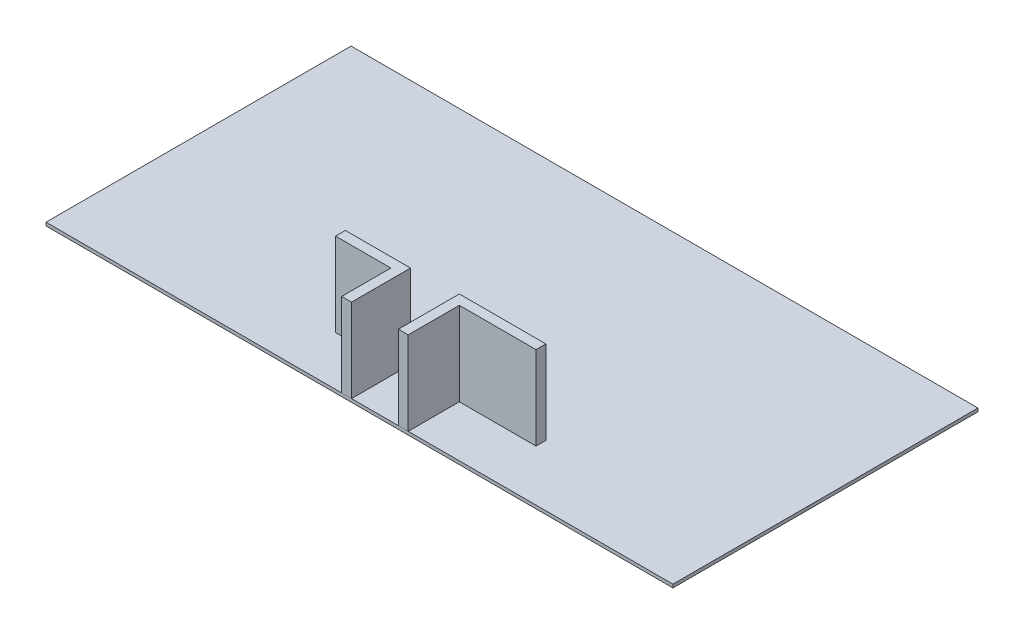
ISO-10303-21;
HEADER;
FILE_DESCRIPTION(('STEP AP214'),'2;1');
FILE_NAME('part.step','',(''),(''),'','','');
FILE_SCHEMA(('AUTOMOTIVE_DESIGN { 1 0 10303 214 1 1 1 1 }'));
ENDSEC;
DATA;
#1=APPLICATION_CONTEXT('core data for automotive mechanical design processes');
#2=APPLICATION_PROTOCOL_DEFINITION('international standard','automotive_design',2000,#1);
#3=PRODUCT_CONTEXT('',#1,'mechanical');
#4=PRODUCT('Part','Part','',(#3));
#5=PRODUCT_RELATED_PRODUCT_CATEGORY('part','',(#4));
#6=PRODUCT_DEFINITION_FORMATION('','',#4);
#7=PRODUCT_DEFINITION_CONTEXT('part definition',#1,'design');
#8=PRODUCT_DEFINITION('design','',#6,#7);
#9=PRODUCT_DEFINITION_SHAPE('','',#8);
#10=(LENGTH_UNIT() NAMED_UNIT(*) SI_UNIT(.MILLI.,.METRE.));
#11=(NAMED_UNIT(*) PLANE_ANGLE_UNIT() SI_UNIT($,.RADIAN.));
#12=(NAMED_UNIT(*) SI_UNIT($,.STERADIAN.) SOLID_ANGLE_UNIT());
#13=UNCERTAINTY_MEASURE_WITH_UNIT(LENGTH_MEASURE(1.E-05),#10,'distance_accuracy_value','');
#14=(GEOMETRIC_REPRESENTATION_CONTEXT(3) GLOBAL_UNCERTAINTY_ASSIGNED_CONTEXT((#13)) GLOBAL_UNIT_ASSIGNED_CONTEXT((#10,
#11,#12)) REPRESENTATION_CONTEXT('',''));
#15=CARTESIAN_POINT('',(0.,0.,0.));
#16=DIRECTION('',(0.,0.,1.));
#17=DIRECTION('',(1.,0.,0.));
#18=AXIS2_PLACEMENT_3D('',#15,#16,#17);
#19=CARTESIAN_POINT('',(-9023.74356584846,-100.,1800.));
#20=DIRECTION('',(1.,0.,0.));
#21=DIRECTION('',(0.,0.,-1.));
#22=AXIS2_PLACEMENT_3D('',#19,#20,#21);
#23=PLANE('',#22);
#24=DIRECTION('',(0.,0.,-1.));
#25=VECTOR('',#24,1.);
#26=CARTESIAN_POINT('',(-9023.74356584846,0.,1800.));
#27=LINE('',#26,#25);
#28=CARTESIAN_POINT('',(-9023.74356584846,0.,1800.));
#29=VERTEX_POINT('',#28);
#30=CARTESIAN_POINT('',(-9023.74356584846,0.,-7509.60475321558));
#31=VERTEX_POINT('',#30);
#32=EDGE_CURVE('E108',#29,#31,#27,.T.);
#33=ORIENTED_EDGE('',*,*,#32,.T.);
#34=DIRECTION('',(0.,1.,0.));
#35=VECTOR('',#34,1.);
#36=CARTESIAN_POINT('',(-9023.74356584846,-100.,-7509.60475321558));
#37=LINE('',#36,#35);
#38=CARTESIAN_POINT('',(-9023.74356584846,-100.,-7509.60475321558));
#39=VERTEX_POINT('',#38);
#40=EDGE_CURVE('E12',#39,#31,#37,.T.);
#41=ORIENTED_EDGE('',*,*,#40,.F.);
#42=DIRECTION('',(0.,0.,-1.));
#43=VECTOR('',#42,1.);
#44=CARTESIAN_POINT('',(-9023.74356584846,-100.,1800.));
#45=LINE('',#44,#43);
#46=CARTESIAN_POINT('',(-9023.74356584846,-100.,1800.));
#47=VERTEX_POINT('',#46);
#48=EDGE_CURVE('E96',#47,#39,#45,.T.);
#49=ORIENTED_EDGE('',*,*,#48,.F.);
#50=DIRECTION('',(0.,1.,0.));
#51=VECTOR('',#50,1.);
#52=CARTESIAN_POINT('',(-9023.74356584846,-100.,1800.));
#53=LINE('',#52,#51);
#54=EDGE_CURVE('E104',#47,#29,#53,.T.);
#55=ORIENTED_EDGE('',*,*,#54,.T.);
#56=EDGE_LOOP('',(#33,#41,#49,#55));
#57=FACE_BOUND('',#56,.T.);
#58=ADVANCED_FACE('F45',(#57),#23,.F.);
#59=CARTESIAN_POINT('',(-9023.74356584846,-100.,-7509.60475321558));
#60=DIRECTION('',(0.,0.,1.));
#61=DIRECTION('',(1.,0.,0.));
#62=AXIS2_PLACEMENT_3D('',#59,#60,#61);
#63=PLANE('',#62);
#64=DIRECTION('',(1.,0.,0.));
#65=VECTOR('',#64,1.);
#66=CARTESIAN_POINT('',(-9023.74356584846,0.,-7509.60475321558));
#67=LINE('',#66,#65);
#68=CARTESIAN_POINT('',(10107.5864082724,0.,-7509.60475321558));
#69=VERTEX_POINT('',#68);
#70=EDGE_CURVE('E100',#31,#69,#67,.T.);
#71=ORIENTED_EDGE('',*,*,#70,.T.);
#72=DIRECTION('',(0.,1.,0.));
#73=VECTOR('',#72,1.);
#74=CARTESIAN_POINT('',(10107.5864082724,-100.,-7509.60475321558));
#75=LINE('',#74,#73);
#76=CARTESIAN_POINT('',(10107.5864082724,-100.,-7509.60475321558));
#77=VERTEX_POINT('',#76);
#78=EDGE_CURVE('E53',#77,#69,#75,.T.);
#79=ORIENTED_EDGE('',*,*,#78,.F.);
#80=DIRECTION('',(1.,0.,0.));
#81=VECTOR('',#80,1.);
#82=CARTESIAN_POINT('',(-9023.74356584846,-100.,-7509.60475321558));
#83=LINE('',#82,#81);
#84=EDGE_CURVE('E91',#39,#77,#83,.T.);
#85=ORIENTED_EDGE('',*,*,#84,.F.);
#86=ORIENTED_EDGE('',*,*,#40,.T.);
#87=EDGE_LOOP('',(#71,#79,#85,#86));
#88=FACE_BOUND('',#87,.T.);
#89=ADVANCED_FACE('F99',(#88),#63,.F.);
#90=CARTESIAN_POINT('',(10107.5864082724,-100.,1800.));
#91=DIRECTION('',(-1.,0.,0.));
#92=DIRECTION('',(0.,0.,1.));
#93=AXIS2_PLACEMENT_3D('',#90,#91,#92);
#94=PLANE('',#93);
#95=DIRECTION('',(0.,0.,1.));
#96=VECTOR('',#95,1.);
#97=CARTESIAN_POINT('',(10107.5864082724,0.,1800.));
#98=LINE('',#97,#96);
#99=CARTESIAN_POINT('',(10107.5864082724,0.,1800.));
#100=VERTEX_POINT('',#99);
#101=EDGE_CURVE('E78',#69,#100,#98,.T.);
#102=ORIENTED_EDGE('',*,*,#101,.T.);
#103=DIRECTION('',(0.,1.,0.));
#104=VECTOR('',#103,1.);
#105=CARTESIAN_POINT('',(10107.5864082724,-100.,1800.));
#106=LINE('',#105,#104);
#107=CARTESIAN_POINT('',(10107.5864082724,-100.,1800.));
#108=VERTEX_POINT('',#107);
#109=EDGE_CURVE('E101',#108,#100,#106,.T.);
#110=ORIENTED_EDGE('',*,*,#109,.F.);
#111=DIRECTION('',(0.,0.,1.));
#112=VECTOR('',#111,1.);
#113=CARTESIAN_POINT('',(10107.5864082724,-100.,1800.));
#114=LINE('',#113,#112);
#115=EDGE_CURVE('E94',#77,#108,#114,.T.);
#116=ORIENTED_EDGE('',*,*,#115,.F.);
#117=ORIENTED_EDGE('',*,*,#78,.T.);
#118=EDGE_LOOP('',(#102,#110,#116,#117));
#119=FACE_BOUND('',#118,.T.);
#120=ADVANCED_FACE('F102',(#119),#94,.F.);
#121=CARTESIAN_POINT('',(-9023.74356584846,-100.,1800.));
#122=DIRECTION('',(0.,0.,-1.));
#123=DIRECTION('',(-1.,0.,0.));
#124=AXIS2_PLACEMENT_3D('',#121,#122,#123);
#125=PLANE('',#124);
#126=DIRECTION('',(-1.,0.,0.));
#127=VECTOR('',#126,1.);
#128=CARTESIAN_POINT('',(-9023.74356584846,0.,1800.));
#129=LINE('',#128,#127);
#130=EDGE_CURVE('E84',#100,#29,#129,.T.);
#131=ORIENTED_EDGE('',*,*,#130,.T.);
#132=ORIENTED_EDGE('',*,*,#54,.F.);
#133=DIRECTION('',(-1.,0.,0.));
#134=VECTOR('',#133,1.);
#135=CARTESIAN_POINT('',(-9023.74356584846,-100.,1800.));
#136=LINE('',#135,#134);
#137=EDGE_CURVE('E61',#108,#47,#136,.T.);
#138=ORIENTED_EDGE('',*,*,#137,.F.);
#139=ORIENTED_EDGE('',*,*,#109,.T.);
#140=EDGE_LOOP('',(#131,#132,#138,#139));
#141=FACE_BOUND('',#140,.T.);
#142=ADVANCED_FACE('F115',(#141),#125,.F.);
#143=CARTESIAN_POINT('',(0.,-100.,0.));
#144=DIRECTION('',(0.,-1.,0.));
#145=DIRECTION('',(0.,0.,-1.));
#146=AXIS2_PLACEMENT_3D('',#143,#144,#145);
#147=PLANE('',#146);
#148=ORIENTED_EDGE('',*,*,#48,.T.);
#149=ORIENTED_EDGE('',*,*,#84,.T.);
#150=ORIENTED_EDGE('',*,*,#115,.T.);
#151=ORIENTED_EDGE('',*,*,#137,.T.);
#152=EDGE_LOOP('',(#148,#149,#150,#151));
#153=FACE_BOUND('',#152,.T.);
#154=ADVANCED_FACE('F92',(#153),#147,.T.);
#155=CARTESIAN_POINT('',(0.,0.,0.));
#156=DIRECTION('',(0.,-1.,0.));
#157=DIRECTION('',(0.,0.,-1.));
#158=AXIS2_PLACEMENT_3D('',#155,#156,#157);
#159=PLANE('',#158);
#160=ORIENTED_EDGE('',*,*,#32,.F.);
#161=ORIENTED_EDGE('',*,*,#130,.F.);
#162=ORIENTED_EDGE('',*,*,#101,.F.);
#163=ORIENTED_EDGE('',*,*,#70,.F.);
#164=EDGE_LOOP('',(#160,#161,#162,#163));
#165=FACE_BOUND('',#164,.T.);
#166=ADVANCED_FACE('F118',(#165),#159,.F.);
#167=CLOSED_SHELL('',(#58,#89,#120,#142,#154,#166));
#168=MANIFOLD_SOLID_BREP('B2',#167);
#169=CARTESIAN_POINT('',(-1687.59713801505,2550.,2.43410447306457E-13));
#170=DIRECTION('',(1.,0.,0.));
#171=DIRECTION('',(0.,0.,-1.));
#172=AXIS2_PLACEMENT_3D('',#169,#170,#171);
#173=PLANE('',#172);
#174=DIRECTION('',(0.,0.,1.));
#175=VECTOR('',#174,1.);
#176=CARTESIAN_POINT('',(-1687.59713801505,0.,2.43410447306457E-13));
#177=LINE('',#176,#175);
#178=CARTESIAN_POINT('',(-1687.59713801505,0.,2.43410447306457E-13));
#179=VERTEX_POINT('',#178);
#180=CARTESIAN_POINT('',(-1687.59713801505,0.,300.));
#181=VERTEX_POINT('',#180);
#182=EDGE_CURVE('E263',#179,#181,#177,.T.);
#183=ORIENTED_EDGE('',*,*,#182,.T.);
#184=DIRECTION('',(0.,-1.,0.));
#185=VECTOR('',#184,1.);
#186=CARTESIAN_POINT('',(-1687.59713801505,2550.,300.));
#187=LINE('',#186,#185);
#188=CARTESIAN_POINT('',(-1687.59713801505,2550.,300.));
#189=VERTEX_POINT('',#188);
#190=EDGE_CURVE('E43',#189,#181,#187,.T.);
#191=ORIENTED_EDGE('',*,*,#190,.F.);
#192=DIRECTION('',(0.,0.,1.));
#193=VECTOR('',#192,1.);
#194=CARTESIAN_POINT('',(-1687.59713801505,2550.,2.43410447306457E-13));
#195=LINE('',#194,#193);
#196=CARTESIAN_POINT('',(-1687.59713801505,2550.,2.43410447306457E-13));
#197=VERTEX_POINT('',#196);
#198=EDGE_CURVE('E273',#197,#189,#195,.T.);
#199=ORIENTED_EDGE('',*,*,#198,.F.);
#200=DIRECTION('',(0.,-1.,0.));
#201=VECTOR('',#200,1.);
#202=CARTESIAN_POINT('',(-1687.59713801505,2550.,2.43410447306457E-13));
#203=LINE('',#202,#201);
#204=EDGE_CURVE('E259',#197,#179,#203,.T.);
#205=ORIENTED_EDGE('',*,*,#204,.T.);
#206=EDGE_LOOP('',(#183,#191,#199,#205));
#207=FACE_BOUND('',#206,.T.);
#208=ADVANCED_FACE('F179',(#207),#173,.F.);
#209=CARTESIAN_POINT('',(-1687.59713801505,2550.,300.));
#210=DIRECTION('',(0.,0.,-1.));
#211=DIRECTION('',(-1.,0.,0.));
#212=AXIS2_PLACEMENT_3D('',#209,#210,#211);
#213=PLANE('',#212);
#214=DIRECTION('',(1.,0.,0.));
#215=VECTOR('',#214,1.);
#216=CARTESIAN_POINT('',(-1687.59713801505,0.,300.));
#217=LINE('',#216,#215);
#218=CARTESIAN_POINT('',(0.,0.,300.));
#219=VERTEX_POINT('',#218);
#220=EDGE_CURVE('E266',#181,#219,#217,.T.);
#221=ORIENTED_EDGE('',*,*,#220,.T.);
#222=DIRECTION('',(0.,-1.,0.));
#223=VECTOR('',#222,1.);
#224=CARTESIAN_POINT('',(0.,2550.,300.));
#225=LINE('',#224,#223);
#226=CARTESIAN_POINT('',(0.,2550.,300.));
#227=VERTEX_POINT('',#226);
#228=EDGE_CURVE('E187',#227,#219,#225,.T.);
#229=ORIENTED_EDGE('',*,*,#228,.F.);
#230=DIRECTION('',(1.,0.,0.));
#231=VECTOR('',#230,1.);
#232=CARTESIAN_POINT('',(-1687.59713801505,2550.,300.));
#233=LINE('',#232,#231);
#234=EDGE_CURVE('E232',#189,#227,#233,.T.);
#235=ORIENTED_EDGE('',*,*,#234,.F.);
#236=ORIENTED_EDGE('',*,*,#190,.T.);
#237=EDGE_LOOP('',(#221,#229,#235,#236));
#238=FACE_BOUND('',#237,.T.);
#239=ADVANCED_FACE('F297',(#238),#213,.F.);
#240=CARTESIAN_POINT('',(0.,2550.,300.));
#241=DIRECTION('',(1.,0.,0.));
#242=DIRECTION('',(0.,0.,-1.));
#243=AXIS2_PLACEMENT_3D('',#240,#241,#242);
#244=PLANE('',#243);
#245=DIRECTION('',(0.,0.,1.));
#246=VECTOR('',#245,1.);
#247=CARTESIAN_POINT('',(0.,0.,300.));
#248=LINE('',#247,#246);
#249=CARTESIAN_POINT('',(1.83697019872103E-13,0.,1800.));
#250=VERTEX_POINT('',#249);
#251=EDGE_CURVE('E268',#219,#250,#248,.T.);
#252=ORIENTED_EDGE('',*,*,#251,.T.);
#253=DIRECTION('',(0.,-1.,0.));
#254=VECTOR('',#253,1.);
#255=CARTESIAN_POINT('',(1.83697019872103E-13,2550.,1800.));
#256=LINE('',#255,#254);
#257=CARTESIAN_POINT('',(1.83697019872103E-13,2550.,1800.));
#258=VERTEX_POINT('',#257);
#259=EDGE_CURVE('E254',#258,#250,#256,.T.);
#260=ORIENTED_EDGE('',*,*,#259,.F.);
#261=DIRECTION('',(0.,0.,1.));
#262=VECTOR('',#261,1.);
#263=CARTESIAN_POINT('',(0.,2550.,300.));
#264=LINE('',#263,#262);
#265=EDGE_CURVE('E245',#227,#258,#264,.T.);
#266=ORIENTED_EDGE('',*,*,#265,.F.);
#267=ORIENTED_EDGE('',*,*,#228,.T.);
#268=EDGE_LOOP('',(#252,#260,#266,#267));
#269=FACE_BOUND('',#268,.T.);
#270=ADVANCED_FACE('F279',(#269),#244,.F.);
#271=CARTESIAN_POINT('',(1.83697019872103E-13,2550.,1800.));
#272=DIRECTION('',(0.,0.,-1.));
#273=DIRECTION('',(-1.,0.,0.));
#274=AXIS2_PLACEMENT_3D('',#271,#272,#273);
#275=PLANE('',#274);
#276=DIRECTION('',(1.,0.,0.));
#277=VECTOR('',#276,1.);
#278=CARTESIAN_POINT('',(1.83697019872103E-13,0.,1800.));
#279=LINE('',#278,#277);
#280=CARTESIAN_POINT('',(300.,0.,1800.));
#281=VERTEX_POINT('',#280);
#282=EDGE_CURVE('E253',#250,#281,#279,.T.);
#283=ORIENTED_EDGE('',*,*,#282,.T.);
#284=DIRECTION('',(0.,-1.,0.));
#285=VECTOR('',#284,1.);
#286=CARTESIAN_POINT('',(300.,2550.,1800.));
#287=LINE('',#286,#285);
#288=CARTESIAN_POINT('',(300.,2550.,1800.));
#289=VERTEX_POINT('',#288);
#290=EDGE_CURVE('E250',#289,#281,#287,.T.);
#291=ORIENTED_EDGE('',*,*,#290,.F.);
#292=DIRECTION('',(1.,0.,0.));
#293=VECTOR('',#292,1.);
#294=CARTESIAN_POINT('',(1.83697019872103E-13,2550.,1800.));
#295=LINE('',#294,#293);
#296=EDGE_CURVE('E239',#258,#289,#295,.T.);
#297=ORIENTED_EDGE('',*,*,#296,.F.);
#298=ORIENTED_EDGE('',*,*,#259,.T.);
#299=EDGE_LOOP('',(#283,#291,#297,#298));
#300=FACE_BOUND('',#299,.T.);
#301=ADVANCED_FACE('F251',(#300),#275,.F.);
#302=CARTESIAN_POINT('',(300.,2550.,1800.));
#303=DIRECTION('',(-1.,0.,0.));
#304=DIRECTION('',(0.,0.,1.));
#305=AXIS2_PLACEMENT_3D('',#302,#303,#304);
#306=PLANE('',#305);
#307=DIRECTION('',(0.,0.,-1.));
#308=VECTOR('',#307,1.);
#309=CARTESIAN_POINT('',(300.,0.,1800.));
#310=LINE('',#309,#308);
#311=CARTESIAN_POINT('',(300.,0.,0.));
#312=VERTEX_POINT('',#311);
#313=EDGE_CURVE('E218',#281,#312,#310,.T.);
#314=ORIENTED_EDGE('',*,*,#313,.T.);
#315=DIRECTION('',(0.,-1.,0.));
#316=VECTOR('',#315,1.);
#317=CARTESIAN_POINT('',(300.,2550.,0.));
#318=LINE('',#317,#316);
#319=CARTESIAN_POINT('',(300.,2550.,0.));
#320=VERTEX_POINT('',#319);
#321=EDGE_CURVE('E255',#320,#312,#318,.T.);
#322=ORIENTED_EDGE('',*,*,#321,.F.);
#323=DIRECTION('',(0.,0.,-1.));
#324=VECTOR('',#323,1.);
#325=CARTESIAN_POINT('',(300.,2550.,1800.));
#326=LINE('',#325,#324);
#327=EDGE_CURVE('E243',#289,#320,#326,.T.);
#328=ORIENTED_EDGE('',*,*,#327,.F.);
#329=ORIENTED_EDGE('',*,*,#290,.T.);
#330=EDGE_LOOP('',(#314,#322,#328,#329));
#331=FACE_BOUND('',#330,.T.);
#332=ADVANCED_FACE('F257',(#331),#306,.F.);
#333=CARTESIAN_POINT('',(300.,2550.,0.));
#334=DIRECTION('',(0.,0.,1.));
#335=DIRECTION('',(1.,0.,0.));
#336=AXIS2_PLACEMENT_3D('',#333,#334,#335);
#337=PLANE('',#336);
#338=DIRECTION('',(-1.,0.,0.));
#339=VECTOR('',#338,1.);
#340=CARTESIAN_POINT('',(300.,0.,0.));
#341=LINE('',#340,#339);
#342=EDGE_CURVE('E224',#312,#179,#341,.T.);
#343=ORIENTED_EDGE('',*,*,#342,.T.);
#344=ORIENTED_EDGE('',*,*,#204,.F.);
#345=DIRECTION('',(-1.,0.,0.));
#346=VECTOR('',#345,1.);
#347=CARTESIAN_POINT('',(300.,2550.,0.));
#348=LINE('',#347,#346);
#349=EDGE_CURVE('E195',#320,#197,#348,.T.);
#350=ORIENTED_EDGE('',*,*,#349,.F.);
#351=ORIENTED_EDGE('',*,*,#321,.T.);
#352=EDGE_LOOP('',(#343,#344,#350,#351));
#353=FACE_BOUND('',#352,.T.);
#354=ADVANCED_FACE('F286',(#353),#337,.F.);
#355=CARTESIAN_POINT('',(0.,2550.,0.));
#356=DIRECTION('',(0.,1.,0.));
#357=DIRECTION('',(0.,0.,1.));
#358=AXIS2_PLACEMENT_3D('',#355,#356,#357);
#359=PLANE('',#358);
#360=ORIENTED_EDGE('',*,*,#198,.T.);
#361=ORIENTED_EDGE('',*,*,#234,.T.);
#362=ORIENTED_EDGE('',*,*,#265,.T.);
#363=ORIENTED_EDGE('',*,*,#296,.T.);
#364=ORIENTED_EDGE('',*,*,#327,.T.);
#365=ORIENTED_EDGE('',*,*,#349,.T.);
#366=EDGE_LOOP('',(#360,#361,#362,#363,#364,#365));
#367=FACE_BOUND('',#366,.T.);
#368=ADVANCED_FACE('F241',(#367),#359,.T.);
#369=CARTESIAN_POINT('',(0.,0.,0.));
#370=DIRECTION('',(0.,1.,0.));
#371=DIRECTION('',(0.,0.,1.));
#372=AXIS2_PLACEMENT_3D('',#369,#370,#371);
#373=PLANE('',#372);
#374=ORIENTED_EDGE('',*,*,#182,.F.);
#375=ORIENTED_EDGE('',*,*,#342,.F.);
#376=ORIENTED_EDGE('',*,*,#313,.F.);
#377=ORIENTED_EDGE('',*,*,#282,.F.);
#378=ORIENTED_EDGE('',*,*,#251,.F.);
#379=ORIENTED_EDGE('',*,*,#220,.F.);
#380=EDGE_LOOP('',(#374,#375,#376,#377,#378,#379));
#381=FACE_BOUND('',#380,.T.);
#382=ADVANCED_FACE('F282',(#381),#373,.F.);
#383=CLOSED_SHELL('',(#208,#239,#270,#301,#332,#354,#368,#382));
#384=MANIFOLD_SOLID_BREP('B6',#383);
#385=CARTESIAN_POINT('',(1730.,2550.,1800.));
#386=DIRECTION('',(1.,0.,0.));
#387=DIRECTION('',(0.,0.,-1.));
#388=AXIS2_PLACEMENT_3D('',#385,#386,#387);
#389=PLANE('',#388);
#390=DIRECTION('',(0.,0.,1.));
#391=VECTOR('',#390,1.);
#392=CARTESIAN_POINT('',(1730.,0.,1800.));
#393=LINE('',#392,#391);
#394=CARTESIAN_POINT('',(1730.,0.,-59.9999999999999));
#395=VERTEX_POINT('',#394);
#396=CARTESIAN_POINT('',(1730.,0.,1800.));
#397=VERTEX_POINT('',#396);
#398=EDGE_CURVE('E438',#395,#397,#393,.T.);
#399=ORIENTED_EDGE('',*,*,#398,.T.);
#400=DIRECTION('',(0.,-1.,0.));
#401=VECTOR('',#400,1.);
#402=CARTESIAN_POINT('',(1730.,2550.,1800.));
#403=LINE('',#402,#401);
#404=CARTESIAN_POINT('',(1730.,2550.,1800.));
#405=VERTEX_POINT('',#404);
#406=EDGE_CURVE('E177',#405,#397,#403,.T.);
#407=ORIENTED_EDGE('',*,*,#406,.F.);
#408=DIRECTION('',(0.,0.,1.));
#409=VECTOR('',#408,1.);
#410=CARTESIAN_POINT('',(1730.,2550.,1800.));
#411=LINE('',#410,#409);
#412=CARTESIAN_POINT('',(1730.,2550.,-59.9999999999999));
#413=VERTEX_POINT('',#412);
#414=EDGE_CURVE('E448',#413,#405,#411,.T.);
#415=ORIENTED_EDGE('',*,*,#414,.F.);
#416=DIRECTION('',(0.,-1.,0.));
#417=VECTOR('',#416,1.);
#418=CARTESIAN_POINT('',(1730.,2550.,-59.9999999999999));
#419=LINE('',#418,#417);
#420=EDGE_CURVE('E434',#413,#395,#419,.T.);
#421=ORIENTED_EDGE('',*,*,#420,.T.);
#422=EDGE_LOOP('',(#399,#407,#415,#421));
#423=FACE_BOUND('',#422,.T.);
#424=ADVANCED_FACE('F354',(#423),#389,.F.);
#425=CARTESIAN_POINT('',(2030.,2550.,1800.));
#426=DIRECTION('',(0.,0.,-1.));
#427=DIRECTION('',(-1.,0.,0.));
#428=AXIS2_PLACEMENT_3D('',#425,#426,#427);
#429=PLANE('',#428);
#430=DIRECTION('',(1.,0.,0.));
#431=VECTOR('',#430,1.);
#432=CARTESIAN_POINT('',(2030.,0.,1800.));
#433=LINE('',#432,#431);
#434=CARTESIAN_POINT('',(2030.,0.,1800.));
#435=VERTEX_POINT('',#434);
#436=EDGE_CURVE('E441',#397,#435,#433,.T.);
#437=ORIENTED_EDGE('',*,*,#436,.T.);
#438=DIRECTION('',(0.,-1.,0.));
#439=VECTOR('',#438,1.);
#440=CARTESIAN_POINT('',(2030.,2550.,1800.));
#441=LINE('',#440,#439);
#442=CARTESIAN_POINT('',(2030.,2550.,1800.));
#443=VERTEX_POINT('',#442);
#444=EDGE_CURVE('E362',#443,#435,#441,.T.);
#445=ORIENTED_EDGE('',*,*,#444,.F.);
#446=DIRECTION('',(1.,0.,0.));
#447=VECTOR('',#446,1.);
#448=CARTESIAN_POINT('',(2030.,2550.,1800.));
#449=LINE('',#448,#447);
#450=EDGE_CURVE('E407',#405,#443,#449,.T.);
#451=ORIENTED_EDGE('',*,*,#450,.F.);
#452=ORIENTED_EDGE('',*,*,#406,.T.);
#453=EDGE_LOOP('',(#437,#445,#451,#452));
#454=FACE_BOUND('',#453,.T.);
#455=ADVANCED_FACE('F472',(#454),#429,.F.);
#456=CARTESIAN_POINT('',(2030.,2550.,1800.));
#457=DIRECTION('',(-1.,0.,0.));
#458=DIRECTION('',(0.,0.,1.));
#459=AXIS2_PLACEMENT_3D('',#456,#457,#458);
#460=PLANE('',#459);
#461=DIRECTION('',(0.,0.,-1.));
#462=VECTOR('',#461,1.);
#463=CARTESIAN_POINT('',(2030.,0.,1800.));
#464=LINE('',#463,#462);
#465=CARTESIAN_POINT('',(2030.,0.,240.));
#466=VERTEX_POINT('',#465);
#467=EDGE_CURVE('E443',#435,#466,#464,.T.);
#468=ORIENTED_EDGE('',*,*,#467,.T.);
#469=DIRECTION('',(0.,-1.,0.));
#470=VECTOR('',#469,1.);
#471=CARTESIAN_POINT('',(2030.,2550.,240.));
#472=LINE('',#471,#470);
#473=CARTESIAN_POINT('',(2030.,2550.,240.));
#474=VERTEX_POINT('',#473);
#475=EDGE_CURVE('E429',#474,#466,#472,.T.);
#476=ORIENTED_EDGE('',*,*,#475,.F.);
#477=DIRECTION('',(0.,0.,-1.));
#478=VECTOR('',#477,1.);
#479=CARTESIAN_POINT('',(2030.,2550.,1800.));
#480=LINE('',#479,#478);
#481=EDGE_CURVE('E420',#443,#474,#480,.T.);
#482=ORIENTED_EDGE('',*,*,#481,.F.);
#483=ORIENTED_EDGE('',*,*,#444,.T.);
#484=EDGE_LOOP('',(#468,#476,#482,#483));
#485=FACE_BOUND('',#484,.T.);
#486=ADVANCED_FACE('F454',(#485),#460,.F.);
#487=CARTESIAN_POINT('',(2030.,2550.,240.));
#488=DIRECTION('',(0.,0.,-1.));
#489=DIRECTION('',(-1.,0.,0.));
#490=AXIS2_PLACEMENT_3D('',#487,#488,#489);
#491=PLANE('',#490);
#492=DIRECTION('',(1.,0.,0.));
#493=VECTOR('',#492,1.);
#494=CARTESIAN_POINT('',(2030.,0.,240.));
#495=LINE('',#494,#493);
#496=CARTESIAN_POINT('',(4369.5644478058,0.,240.));
#497=VERTEX_POINT('',#496);
#498=EDGE_CURVE('E428',#466,#497,#495,.T.);
#499=ORIENTED_EDGE('',*,*,#498,.T.);
#500=DIRECTION('',(0.,-1.,0.));
#501=VECTOR('',#500,1.);
#502=CARTESIAN_POINT('',(4369.5644478058,2550.,240.));
#503=LINE('',#502,#501);
#504=CARTESIAN_POINT('',(4369.5644478058,2550.,240.));
#505=VERTEX_POINT('',#504);
#506=EDGE_CURVE('E425',#505,#497,#503,.T.);
#507=ORIENTED_EDGE('',*,*,#506,.F.);
#508=DIRECTION('',(1.,0.,0.));
#509=VECTOR('',#508,1.);
#510=CARTESIAN_POINT('',(2030.,2550.,240.));
#511=LINE('',#510,#509);
#512=EDGE_CURVE('E414',#474,#505,#511,.T.);
#513=ORIENTED_EDGE('',*,*,#512,.F.);
#514=ORIENTED_EDGE('',*,*,#475,.T.);
#515=EDGE_LOOP('',(#499,#507,#513,#514));
#516=FACE_BOUND('',#515,.T.);
#517=ADVANCED_FACE('F426',(#516),#491,.F.);
#518=CARTESIAN_POINT('',(4369.5644478058,2550.,240.));
#519=DIRECTION('',(-1.,0.,0.));
#520=DIRECTION('',(0.,0.,1.));
#521=AXIS2_PLACEMENT_3D('',#518,#519,#520);
#522=PLANE('',#521);
#523=DIRECTION('',(0.,0.,-1.));
#524=VECTOR('',#523,1.);
#525=CARTESIAN_POINT('',(4369.5644478058,0.,240.));
#526=LINE('',#525,#524);
#527=CARTESIAN_POINT('',(4369.5644478058,0.,-59.9999999999999));
#528=VERTEX_POINT('',#527);
#529=EDGE_CURVE('E393',#497,#528,#526,.T.);
#530=ORIENTED_EDGE('',*,*,#529,.T.);
#531=DIRECTION('',(0.,-1.,0.));
#532=VECTOR('',#531,1.);
#533=CARTESIAN_POINT('',(4369.5644478058,2550.,-59.9999999999999));
#534=LINE('',#533,#532);
#535=CARTESIAN_POINT('',(4369.5644478058,2550.,-59.9999999999999));
#536=VERTEX_POINT('',#535);
#537=EDGE_CURVE('E430',#536,#528,#534,.T.);
#538=ORIENTED_EDGE('',*,*,#537,.F.);
#539=DIRECTION('',(0.,0.,-1.));
#540=VECTOR('',#539,1.);
#541=CARTESIAN_POINT('',(4369.5644478058,2550.,240.));
#542=LINE('',#541,#540);
#543=EDGE_CURVE('E418',#505,#536,#542,.T.);
#544=ORIENTED_EDGE('',*,*,#543,.F.);
#545=ORIENTED_EDGE('',*,*,#506,.T.);
#546=EDGE_LOOP('',(#530,#538,#544,#545));
#547=FACE_BOUND('',#546,.T.);
#548=ADVANCED_FACE('F432',(#547),#522,.F.);
#549=CARTESIAN_POINT('',(1730.,2550.,-59.9999999999999));
#550=DIRECTION('',(0.,0.,1.));
#551=DIRECTION('',(1.,0.,0.));
#552=AXIS2_PLACEMENT_3D('',#549,#550,#551);
#553=PLANE('',#552);
#554=DIRECTION('',(-1.,0.,0.));
#555=VECTOR('',#554,1.);
#556=CARTESIAN_POINT('',(1730.,0.,-59.9999999999999));
#557=LINE('',#556,#555);
#558=EDGE_CURVE('E399',#528,#395,#557,.T.);
#559=ORIENTED_EDGE('',*,*,#558,.T.);
#560=ORIENTED_EDGE('',*,*,#420,.F.);
#561=DIRECTION('',(-1.,0.,0.));
#562=VECTOR('',#561,1.);
#563=CARTESIAN_POINT('',(1730.,2550.,-59.9999999999999));
#564=LINE('',#563,#562);
#565=EDGE_CURVE('E370',#536,#413,#564,.T.);
#566=ORIENTED_EDGE('',*,*,#565,.F.);
#567=ORIENTED_EDGE('',*,*,#537,.T.);
#568=EDGE_LOOP('',(#559,#560,#566,#567));
#569=FACE_BOUND('',#568,.T.);
#570=ADVANCED_FACE('F461',(#569),#553,.F.);
#571=CARTESIAN_POINT('',(0.,2550.,0.));
#572=DIRECTION('',(0.,-1.,0.));
#573=DIRECTION('',(0.,0.,-1.));
#574=AXIS2_PLACEMENT_3D('',#571,#572,#573);
#575=PLANE('',#574);
#576=ORIENTED_EDGE('',*,*,#414,.T.);
#577=ORIENTED_EDGE('',*,*,#450,.T.);
#578=ORIENTED_EDGE('',*,*,#481,.T.);
#579=ORIENTED_EDGE('',*,*,#512,.T.);
#580=ORIENTED_EDGE('',*,*,#543,.T.);
#581=ORIENTED_EDGE('',*,*,#565,.T.);
#582=EDGE_LOOP('',(#576,#577,#578,#579,#580,#581));
#583=FACE_BOUND('',#582,.T.);
#584=ADVANCED_FACE('F416',(#583),#575,.F.);
#585=CARTESIAN_POINT('',(0.,0.,0.));
#586=DIRECTION('',(0.,-1.,0.));
#587=DIRECTION('',(0.,0.,-1.));
#588=AXIS2_PLACEMENT_3D('',#585,#586,#587);
#589=PLANE('',#588);
#590=ORIENTED_EDGE('',*,*,#398,.F.);
#591=ORIENTED_EDGE('',*,*,#558,.F.);
#592=ORIENTED_EDGE('',*,*,#529,.F.);
#593=ORIENTED_EDGE('',*,*,#498,.F.);
#594=ORIENTED_EDGE('',*,*,#467,.F.);
#595=ORIENTED_EDGE('',*,*,#436,.F.);
#596=EDGE_LOOP('',(#590,#591,#592,#593,#594,#595));
#597=FACE_BOUND('',#596,.T.);
#598=ADVANCED_FACE('F457',(#597),#589,.T.);
#599=CLOSED_SHELL('',(#424,#455,#486,#517,#548,#570,#584,#598));
#600=MANIFOLD_SOLID_BREP('B37',#599);
#601=ADVANCED_BREP_SHAPE_REPRESENTATION('',(#18,#168,#384,#600),#14);
#602=SHAPE_DEFINITION_REPRESENTATION(#9,#601);
ENDSEC;
END-ISO-10303-21;
